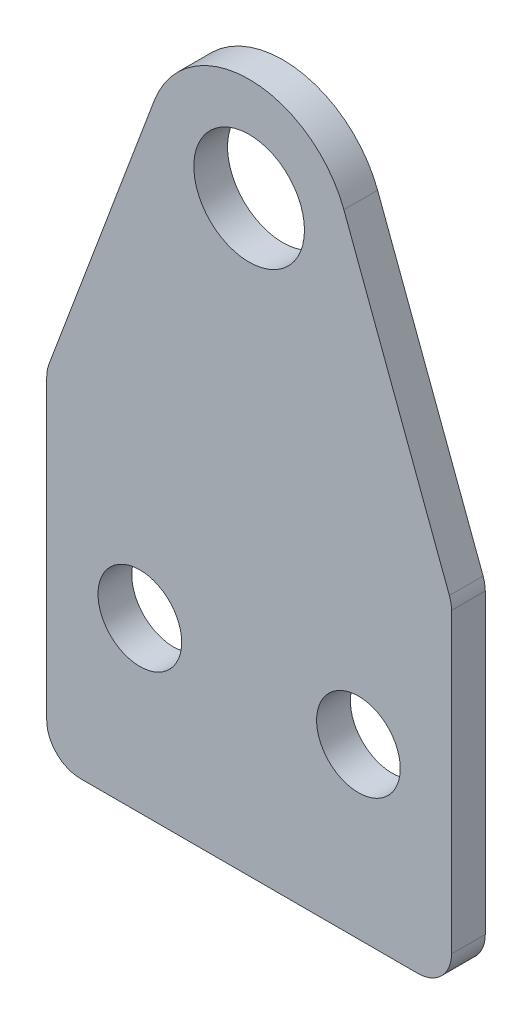
ISO-10303-21;
HEADER;
FILE_DESCRIPTION(('STEP AP214'),'2;1');
FILE_NAME('part.step','',(''),(''),'','','');
FILE_SCHEMA(('AUTOMOTIVE_DESIGN { 1 0 10303 214 1 1 1 1 }'));
ENDSEC;
DATA;
#1=APPLICATION_CONTEXT('core data for automotive mechanical design processes');
#2=APPLICATION_PROTOCOL_DEFINITION('international standard','automotive_design',2000,#1);
#3=PRODUCT_CONTEXT('',#1,'mechanical');
#4=PRODUCT('Part','Part','',(#3));
#5=PRODUCT_RELATED_PRODUCT_CATEGORY('part','',(#4));
#6=PRODUCT_DEFINITION_FORMATION('','',#4);
#7=PRODUCT_DEFINITION_CONTEXT('part definition',#1,'design');
#8=PRODUCT_DEFINITION('design','',#6,#7);
#9=PRODUCT_DEFINITION_SHAPE('','',#8);
#10=(LENGTH_UNIT() NAMED_UNIT(*) SI_UNIT(.MILLI.,.METRE.));
#11=(NAMED_UNIT(*) PLANE_ANGLE_UNIT() SI_UNIT($,.RADIAN.));
#12=(NAMED_UNIT(*) SI_UNIT($,.STERADIAN.) SOLID_ANGLE_UNIT());
#13=UNCERTAINTY_MEASURE_WITH_UNIT(LENGTH_MEASURE(1.E-05),#10,'distance_accuracy_value','');
#14=(GEOMETRIC_REPRESENTATION_CONTEXT(3) GLOBAL_UNCERTAINTY_ASSIGNED_CONTEXT((#13)) GLOBAL_UNIT_ASSIGNED_CONTEXT((#10,
#11,#12)) REPRESENTATION_CONTEXT('',''));
#15=CARTESIAN_POINT('',(0.,0.,0.));
#16=DIRECTION('',(0.,0.,1.));
#17=DIRECTION('',(1.,0.,0.));
#18=AXIS2_PLACEMENT_3D('',#15,#16,#17);
#19=CARTESIAN_POINT('',(0.,0.,2.5));
#20=DIRECTION('',(0.,0.,1.));
#21=DIRECTION('',(1.,0.,0.));
#22=AXIS2_PLACEMENT_3D('',#19,#20,#21);
#23=PLANE('',#22);
#24=CARTESIAN_POINT('',(8.1,0.,2.5));
#25=DIRECTION('',(0.,0.,1.));
#26=DIRECTION('',(1.,0.,0.));
#27=AXIS2_PLACEMENT_3D('',#24,#25,#26);
#28=CIRCLE('',#27,3.1);
#29=CARTESIAN_POINT('',(11.2,0.,2.5));
#30=VERTEX_POINT('',#29);
#31=EDGE_CURVE('E188',#30,#30,#28,.T.);
#32=ORIENTED_EDGE('',*,*,#31,.F.);
#33=EDGE_LOOP('',(#32));
#34=FACE_BOUND('',#33,.T.);
#35=DIRECTION('',(-0.351123441588392,0.936329177569044,0.));
#36=VECTOR('',#35,1.);
#37=CARTESIAN_POINT('',(0.,52.5,2.5));
#38=LINE('',#37,#36);
#39=CARTESIAN_POINT('',(14.8408229439226,12.9244721495397,2.5));
#40=VERTEX_POINT('',#39);
#41=CARTESIAN_POINT('',(7.02246883176783,33.7734164486191,2.5));
#42=VERTEX_POINT('',#41);
#43=EDGE_CURVE('E129',#40,#42,#38,.T.);
#44=ORIENTED_EDGE('',*,*,#43,.T.);
#45=CARTESIAN_POINT('',(0.,31.1399906367062,2.5));
#46=DIRECTION('',(0.,0.,1.));
#47=DIRECTION('',(1.,0.,0.));
#48=AXIS2_PLACEMENT_3D('',#45,#46,#47);
#49=CIRCLE('',#48,7.5);
#50=CARTESIAN_POINT('',(-7.02246883176784,33.7734164486191,2.5));
#51=VERTEX_POINT('',#50);
#52=EDGE_CURVE('E9',#42,#51,#49,.T.);
#53=ORIENTED_EDGE('',*,*,#52,.T.);
#54=DIRECTION('',(-0.351123441588392,-0.936329177569044,0.));
#55=VECTOR('',#54,1.);
#56=CARTESIAN_POINT('',(-15.,12.5,2.5));
#57=LINE('',#56,#55);
#58=CARTESIAN_POINT('',(-14.8408229439226,12.9244721495397,2.5));
#59=VERTEX_POINT('',#58);
#60=EDGE_CURVE('E165',#51,#59,#57,.T.);
#61=ORIENTED_EDGE('',*,*,#60,.T.);
#62=CARTESIAN_POINT('',(-12.5,12.0466635455687,2.5));
#63=DIRECTION('',(0.,0.,1.));
#64=DIRECTION('',(1.,0.,0.));
#65=AXIS2_PLACEMENT_3D('',#62,#63,#64);
#66=CIRCLE('',#65,2.5);
#67=CARTESIAN_POINT('',(-15.,12.0466635455687,2.5));
#68=VERTEX_POINT('',#67);
#69=EDGE_CURVE('E143',#59,#68,#66,.T.);
#70=ORIENTED_EDGE('',*,*,#69,.T.);
#71=DIRECTION('',(0.,-1.,0.));
#72=VECTOR('',#71,1.);
#73=CARTESIAN_POINT('',(-15.,-12.5,2.5));
#74=LINE('',#73,#72);
#75=CARTESIAN_POINT('',(-15.,-10.,2.5));
#76=VERTEX_POINT('',#75);
#77=EDGE_CURVE('E110',#68,#76,#74,.T.);
#78=ORIENTED_EDGE('',*,*,#77,.T.);
#79=CARTESIAN_POINT('',(-12.5,-10.,2.5));
#80=DIRECTION('',(0.,0.,1.));
#81=DIRECTION('',(1.,0.,0.));
#82=AXIS2_PLACEMENT_3D('',#79,#80,#81);
#83=CIRCLE('',#82,2.5);
#84=CARTESIAN_POINT('',(-12.5,-12.5,2.5));
#85=VERTEX_POINT('',#84);
#86=EDGE_CURVE('E137',#76,#85,#83,.T.);
#87=ORIENTED_EDGE('',*,*,#86,.T.);
#88=DIRECTION('',(1.,0.,0.));
#89=VECTOR('',#88,1.);
#90=CARTESIAN_POINT('',(-15.,-12.5,2.5));
#91=LINE('',#90,#89);
#92=CARTESIAN_POINT('',(12.5,-12.5,2.5));
#93=VERTEX_POINT('',#92);
#94=EDGE_CURVE('E180',#85,#93,#91,.T.);
#95=ORIENTED_EDGE('',*,*,#94,.T.);
#96=CARTESIAN_POINT('',(12.5,-10.,2.5));
#97=DIRECTION('',(0.,0.,1.));
#98=DIRECTION('',(1.,0.,0.));
#99=AXIS2_PLACEMENT_3D('',#96,#97,#98);
#100=CIRCLE('',#99,2.5);
#101=CARTESIAN_POINT('',(15.,-10.,2.5));
#102=VERTEX_POINT('',#101);
#103=EDGE_CURVE('E139',#93,#102,#100,.T.);
#104=ORIENTED_EDGE('',*,*,#103,.T.);
#105=DIRECTION('',(0.,1.,0.));
#106=VECTOR('',#105,1.);
#107=CARTESIAN_POINT('',(15.,-12.5,2.5));
#108=LINE('',#107,#106);
#109=CARTESIAN_POINT('',(15.,12.0466635455687,2.5));
#110=VERTEX_POINT('',#109);
#111=EDGE_CURVE('E130',#102,#110,#108,.T.);
#112=ORIENTED_EDGE('',*,*,#111,.T.);
#113=CARTESIAN_POINT('',(12.5,12.0466635455687,2.5));
#114=DIRECTION('',(0.,0.,1.));
#115=DIRECTION('',(1.,0.,0.));
#116=AXIS2_PLACEMENT_3D('',#113,#114,#115);
#117=CIRCLE('',#116,2.5);
#118=EDGE_CURVE('E141',#110,#40,#117,.T.);
#119=ORIENTED_EDGE('',*,*,#118,.T.);
#120=EDGE_LOOP('',(#44,#53,#61,#70,#78,#87,#95,#104,#112,#119));
#121=FACE_BOUND('',#120,.T.);
#122=CARTESIAN_POINT('',(-8.1,0.,2.5));
#123=DIRECTION('',(0.,0.,1.));
#124=DIRECTION('',(1.,0.,0.));
#125=AXIS2_PLACEMENT_3D('',#122,#123,#124);
#126=CIRCLE('',#125,3.1);
#127=CARTESIAN_POINT('',(-5.,0.,2.5));
#128=VERTEX_POINT('',#127);
#129=EDGE_CURVE('E183',#128,#128,#126,.T.);
#130=ORIENTED_EDGE('',*,*,#129,.F.);
#131=EDGE_LOOP('',(#130));
#132=FACE_BOUND('',#131,.T.);
#133=CARTESIAN_POINT('',(0.,31.,2.5));
#134=DIRECTION('',(0.,0.,1.));
#135=DIRECTION('',(1.,0.,0.));
#136=AXIS2_PLACEMENT_3D('',#133,#134,#135);
#137=CIRCLE('',#136,4.1);
#138=CARTESIAN_POINT('',(4.1,31.,2.5));
#139=VERTEX_POINT('',#138);
#140=EDGE_CURVE('E193',#139,#139,#137,.T.);
#141=ORIENTED_EDGE('',*,*,#140,.F.);
#142=EDGE_LOOP('',(#141));
#143=FACE_BOUND('',#142,.T.);
#144=ADVANCED_FACE('F15',(#34,#121,#132,#143),#23,.T.);
#145=CARTESIAN_POINT('',(0.,0.,0.));
#146=DIRECTION('',(0.,0.,1.));
#147=DIRECTION('',(1.,0.,0.));
#148=AXIS2_PLACEMENT_3D('',#145,#146,#147);
#149=PLANE('',#148);
#150=DIRECTION('',(-0.351123441588392,-0.936329177569044,0.));
#151=VECTOR('',#150,1.);
#152=CARTESIAN_POINT('',(-15.,12.5,0.));
#153=LINE('',#152,#151);
#154=CARTESIAN_POINT('',(-7.02246883176784,33.7734164486191,0.));
#155=VERTEX_POINT('',#154);
#156=CARTESIAN_POINT('',(-14.8408229439226,12.9244721495397,0.));
#157=VERTEX_POINT('',#156);
#158=EDGE_CURVE('E118',#155,#157,#153,.T.);
#159=ORIENTED_EDGE('',*,*,#158,.F.);
#160=CARTESIAN_POINT('',(0.,31.1399906367062,0.));
#161=DIRECTION('',(0.,0.,1.));
#162=DIRECTION('',(1.,0.,0.));
#163=AXIS2_PLACEMENT_3D('',#160,#161,#162);
#164=CIRCLE('',#163,7.5);
#165=CARTESIAN_POINT('',(7.02246883176783,33.7734164486191,0.));
#166=VERTEX_POINT('',#165);
#167=EDGE_CURVE('E37',#155,#166,#164,.F.);
#168=ORIENTED_EDGE('',*,*,#167,.T.);
#169=DIRECTION('',(-0.351123441588392,0.936329177569044,0.));
#170=VECTOR('',#169,1.);
#171=CARTESIAN_POINT('',(0.,52.5,0.));
#172=LINE('',#171,#170);
#173=CARTESIAN_POINT('',(14.8408229439226,12.9244721495397,0.));
#174=VERTEX_POINT('',#173);
#175=EDGE_CURVE('E123',#174,#166,#172,.T.);
#176=ORIENTED_EDGE('',*,*,#175,.F.);
#177=CARTESIAN_POINT('',(12.5,12.0466635455687,0.));
#178=DIRECTION('',(0.,0.,1.));
#179=DIRECTION('',(1.,0.,0.));
#180=AXIS2_PLACEMENT_3D('',#177,#178,#179);
#181=CIRCLE('',#180,2.5);
#182=CARTESIAN_POINT('',(15.,12.0466635455687,0.));
#183=VERTEX_POINT('',#182);
#184=EDGE_CURVE('E101',#174,#183,#181,.F.);
#185=ORIENTED_EDGE('',*,*,#184,.T.);
#186=DIRECTION('',(0.,1.,0.));
#187=VECTOR('',#186,1.);
#188=CARTESIAN_POINT('',(15.,-12.5,0.));
#189=LINE('',#188,#187);
#190=CARTESIAN_POINT('',(15.,-10.,0.));
#191=VERTEX_POINT('',#190);
#192=EDGE_CURVE('E121',#191,#183,#189,.T.);
#193=ORIENTED_EDGE('',*,*,#192,.F.);
#194=CARTESIAN_POINT('',(12.5,-10.,0.));
#195=DIRECTION('',(0.,0.,1.));
#196=DIRECTION('',(1.,0.,0.));
#197=AXIS2_PLACEMENT_3D('',#194,#195,#196);
#198=CIRCLE('',#197,2.5);
#199=CARTESIAN_POINT('',(12.5,-12.5,0.));
#200=VERTEX_POINT('',#199);
#201=EDGE_CURVE('E133',#191,#200,#198,.F.);
#202=ORIENTED_EDGE('',*,*,#201,.T.);
#203=DIRECTION('',(1.,0.,0.));
#204=VECTOR('',#203,1.);
#205=CARTESIAN_POINT('',(-15.,-12.5,0.));
#206=LINE('',#205,#204);
#207=CARTESIAN_POINT('',(-12.5,-12.5,0.));
#208=VERTEX_POINT('',#207);
#209=EDGE_CURVE('E117',#208,#200,#206,.T.);
#210=ORIENTED_EDGE('',*,*,#209,.F.);
#211=CARTESIAN_POINT('',(-12.5,-10.,0.));
#212=DIRECTION('',(0.,0.,1.));
#213=DIRECTION('',(1.,0.,0.));
#214=AXIS2_PLACEMENT_3D('',#211,#212,#213);
#215=CIRCLE('',#214,2.5);
#216=CARTESIAN_POINT('',(-15.,-10.,0.));
#217=VERTEX_POINT('',#216);
#218=EDGE_CURVE('E111',#208,#217,#215,.F.);
#219=ORIENTED_EDGE('',*,*,#218,.T.);
#220=DIRECTION('',(0.,-1.,0.));
#221=VECTOR('',#220,1.);
#222=CARTESIAN_POINT('',(-15.,-12.5,0.));
#223=LINE('',#222,#221);
#224=CARTESIAN_POINT('',(-15.,12.0466635455687,0.));
#225=VERTEX_POINT('',#224);
#226=EDGE_CURVE('E107',#225,#217,#223,.T.);
#227=ORIENTED_EDGE('',*,*,#226,.F.);
#228=CARTESIAN_POINT('',(-12.5,12.0466635455687,0.));
#229=DIRECTION('',(0.,0.,1.));
#230=DIRECTION('',(1.,0.,0.));
#231=AXIS2_PLACEMENT_3D('',#228,#229,#230);
#232=CIRCLE('',#231,2.5);
#233=EDGE_CURVE('E93',#225,#157,#232,.F.);
#234=ORIENTED_EDGE('',*,*,#233,.T.);
#235=EDGE_LOOP('',(#159,#168,#176,#185,#193,#202,#210,#219,#227,#234));
#236=FACE_BOUND('',#235,.T.);
#237=CARTESIAN_POINT('',(-8.1,0.,0.));
#238=DIRECTION('',(0.,0.,1.));
#239=DIRECTION('',(1.,0.,0.));
#240=AXIS2_PLACEMENT_3D('',#237,#238,#239);
#241=CIRCLE('',#240,3.1);
#242=CARTESIAN_POINT('',(-5.,0.,0.));
#243=VERTEX_POINT('',#242);
#244=EDGE_CURVE('E176',#243,#243,#241,.T.);
#245=ORIENTED_EDGE('',*,*,#244,.T.);
#246=EDGE_LOOP('',(#245));
#247=FACE_BOUND('',#246,.T.);
#248=CARTESIAN_POINT('',(8.1,0.,0.));
#249=DIRECTION('',(0.,0.,1.));
#250=DIRECTION('',(1.,0.,0.));
#251=AXIS2_PLACEMENT_3D('',#248,#249,#250);
#252=CIRCLE('',#251,3.1);
#253=CARTESIAN_POINT('',(11.2,0.,0.));
#254=VERTEX_POINT('',#253);
#255=EDGE_CURVE('E190',#254,#254,#252,.T.);
#256=ORIENTED_EDGE('',*,*,#255,.T.);
#257=EDGE_LOOP('',(#256));
#258=FACE_BOUND('',#257,.T.);
#259=CARTESIAN_POINT('',(0.,31.,0.));
#260=DIRECTION('',(0.,0.,1.));
#261=DIRECTION('',(1.,0.,0.));
#262=AXIS2_PLACEMENT_3D('',#259,#260,#261);
#263=CIRCLE('',#262,4.1);
#264=CARTESIAN_POINT('',(4.1,31.,0.));
#265=VERTEX_POINT('',#264);
#266=EDGE_CURVE('E196',#265,#265,#263,.T.);
#267=ORIENTED_EDGE('',*,*,#266,.T.);
#268=EDGE_LOOP('',(#267));
#269=FACE_BOUND('',#268,.T.);
#270=ADVANCED_FACE('F114',(#236,#247,#258,#269),#149,.F.);
#271=CARTESIAN_POINT('',(0.,52.5,2.5));
#272=DIRECTION('',(-0.936329177569045,-0.351123441588392,0.));
#273=DIRECTION('',(0.351123441588392,-0.936329177569045,0.));
#274=AXIS2_PLACEMENT_3D('',#271,#272,#273);
#275=PLANE('',#274);
#276=ORIENTED_EDGE('',*,*,#175,.T.);
#277=DIRECTION('',(0.,0.,-1.));
#278=VECTOR('',#277,1.);
#279=CARTESIAN_POINT('',(7.02246883176784,33.7734164486191,2.5));
#280=LINE('',#279,#278);
#281=EDGE_CURVE('E23',#166,#42,#280,.F.);
#282=ORIENTED_EDGE('',*,*,#281,.T.);
#283=ORIENTED_EDGE('',*,*,#43,.F.);
#284=DIRECTION('',(0.,0.,-1.));
#285=VECTOR('',#284,1.);
#286=CARTESIAN_POINT('',(14.8408229439226,12.9244721495397,2.5));
#287=LINE('',#286,#285);
#288=EDGE_CURVE('E145',#40,#174,#287,.T.);
#289=ORIENTED_EDGE('',*,*,#288,.T.);
#290=EDGE_LOOP('',(#276,#282,#283,#289));
#291=FACE_BOUND('',#290,.T.);
#292=ADVANCED_FACE('F212',(#291),#275,.F.);
#293=CARTESIAN_POINT('',(-15.,12.5,2.5));
#294=DIRECTION('',(0.936329177569045,-0.351123441588392,0.));
#295=DIRECTION('',(0.351123441588392,0.936329177569045,0.));
#296=AXIS2_PLACEMENT_3D('',#293,#294,#295);
#297=PLANE('',#296);
#298=ORIENTED_EDGE('',*,*,#60,.F.);
#299=DIRECTION('',(0.,0.,-1.));
#300=VECTOR('',#299,1.);
#301=CARTESIAN_POINT('',(-7.02246883176784,33.7734164486191,2.5));
#302=LINE('',#301,#300);
#303=EDGE_CURVE('E158',#51,#155,#302,.T.);
#304=ORIENTED_EDGE('',*,*,#303,.T.);
#305=ORIENTED_EDGE('',*,*,#158,.T.);
#306=DIRECTION('',(0.,0.,-1.));
#307=VECTOR('',#306,1.);
#308=CARTESIAN_POINT('',(-14.8408229439226,12.9244721495397,2.5));
#309=LINE('',#308,#307);
#310=EDGE_CURVE('E99',#157,#59,#309,.F.);
#311=ORIENTED_EDGE('',*,*,#310,.T.);
#312=EDGE_LOOP('',(#298,#304,#305,#311));
#313=FACE_BOUND('',#312,.T.);
#314=ADVANCED_FACE('F164',(#313),#297,.F.);
#315=CARTESIAN_POINT('',(-15.,-12.5,2.5));
#316=DIRECTION('',(1.,0.,0.));
#317=DIRECTION('',(0.,0.,-1.));
#318=AXIS2_PLACEMENT_3D('',#315,#316,#317);
#319=PLANE('',#318);
#320=ORIENTED_EDGE('',*,*,#77,.F.);
#321=DIRECTION('',(0.,0.,-1.));
#322=VECTOR('',#321,1.);
#323=CARTESIAN_POINT('',(-15.,12.0466635455687,2.5));
#324=LINE('',#323,#322);
#325=EDGE_CURVE('E97',#68,#225,#324,.T.);
#326=ORIENTED_EDGE('',*,*,#325,.T.);
#327=ORIENTED_EDGE('',*,*,#226,.T.);
#328=DIRECTION('',(0.,0.,-1.));
#329=VECTOR('',#328,1.);
#330=CARTESIAN_POINT('',(-15.,-10.,2.5));
#331=LINE('',#330,#329);
#332=EDGE_CURVE('E112',#217,#76,#331,.F.);
#333=ORIENTED_EDGE('',*,*,#332,.T.);
#334=EDGE_LOOP('',(#320,#326,#327,#333));
#335=FACE_BOUND('',#334,.T.);
#336=ADVANCED_FACE('F106',(#335),#319,.F.);
#337=CARTESIAN_POINT('',(-15.,-12.5,2.5));
#338=DIRECTION('',(0.,1.,0.));
#339=DIRECTION('',(0.,0.,1.));
#340=AXIS2_PLACEMENT_3D('',#337,#338,#339);
#341=PLANE('',#340);
#342=ORIENTED_EDGE('',*,*,#209,.T.);
#343=DIRECTION('',(0.,0.,-1.));
#344=VECTOR('',#343,1.);
#345=CARTESIAN_POINT('',(12.5,-12.5,2.5));
#346=LINE('',#345,#344);
#347=EDGE_CURVE('E156',#200,#93,#346,.F.);
#348=ORIENTED_EDGE('',*,*,#347,.T.);
#349=ORIENTED_EDGE('',*,*,#94,.F.);
#350=DIRECTION('',(0.,0.,-1.));
#351=VECTOR('',#350,1.);
#352=CARTESIAN_POINT('',(-12.5,-12.5,2.5));
#353=LINE('',#352,#351);
#354=EDGE_CURVE('E153',#85,#208,#353,.T.);
#355=ORIENTED_EDGE('',*,*,#354,.T.);
#356=EDGE_LOOP('',(#342,#348,#349,#355));
#357=FACE_BOUND('',#356,.T.);
#358=ADVANCED_FACE('F222',(#357),#341,.F.);
#359=CARTESIAN_POINT('',(15.,-12.5,2.5));
#360=DIRECTION('',(-1.,0.,0.));
#361=DIRECTION('',(0.,0.,1.));
#362=AXIS2_PLACEMENT_3D('',#359,#360,#361);
#363=PLANE('',#362);
#364=ORIENTED_EDGE('',*,*,#192,.T.);
#365=DIRECTION('',(0.,0.,-1.));
#366=VECTOR('',#365,1.);
#367=CARTESIAN_POINT('',(15.,12.0466635455687,2.5));
#368=LINE('',#367,#366);
#369=EDGE_CURVE('E151',#183,#110,#368,.F.);
#370=ORIENTED_EDGE('',*,*,#369,.T.);
#371=ORIENTED_EDGE('',*,*,#111,.F.);
#372=DIRECTION('',(0.,0.,-1.));
#373=VECTOR('',#372,1.);
#374=CARTESIAN_POINT('',(15.,-10.,2.5));
#375=LINE('',#374,#373);
#376=EDGE_CURVE('E148',#102,#191,#375,.T.);
#377=ORIENTED_EDGE('',*,*,#376,.T.);
#378=EDGE_LOOP('',(#364,#370,#371,#377));
#379=FACE_BOUND('',#378,.T.);
#380=ADVANCED_FACE('F219',(#379),#363,.F.);
#381=CARTESIAN_POINT('',(-8.1,0.,2.5));
#382=DIRECTION('',(0.,0.,-1.));
#383=DIRECTION('',(-1.,0.,0.));
#384=AXIS2_PLACEMENT_3D('',#381,#382,#383);
#385=CYLINDRICAL_SURFACE('',#384,3.1);
#386=ORIENTED_EDGE('',*,*,#129,.T.);
#387=EDGE_LOOP('',(#386));
#388=FACE_BOUND('',#387,.T.);
#389=ORIENTED_EDGE('',*,*,#244,.F.);
#390=EDGE_LOOP('',(#389));
#391=FACE_BOUND('',#390,.T.);
#392=ADVANCED_FACE('F216',(#388,#391),#385,.F.);
#393=CARTESIAN_POINT('',(8.1,0.,2.5));
#394=DIRECTION('',(0.,0.,-1.));
#395=DIRECTION('',(-1.,0.,0.));
#396=AXIS2_PLACEMENT_3D('',#393,#394,#395);
#397=CYLINDRICAL_SURFACE('',#396,3.1);
#398=ORIENTED_EDGE('',*,*,#31,.T.);
#399=EDGE_LOOP('',(#398));
#400=FACE_BOUND('',#399,.T.);
#401=ORIENTED_EDGE('',*,*,#255,.F.);
#402=EDGE_LOOP('',(#401));
#403=FACE_BOUND('',#402,.T.);
#404=ADVANCED_FACE('F299',(#400,#403),#397,.F.);
#405=CARTESIAN_POINT('',(0.,31.,2.5));
#406=DIRECTION('',(0.,0.,-1.));
#407=DIRECTION('',(-1.,0.,0.));
#408=AXIS2_PLACEMENT_3D('',#405,#406,#407);
#409=CYLINDRICAL_SURFACE('',#408,4.1);
#410=ORIENTED_EDGE('',*,*,#140,.T.);
#411=EDGE_LOOP('',(#410));
#412=FACE_BOUND('',#411,.T.);
#413=ORIENTED_EDGE('',*,*,#266,.F.);
#414=EDGE_LOOP('',(#413));
#415=FACE_BOUND('',#414,.T.);
#416=ADVANCED_FACE('F202',(#412,#415),#409,.F.);
#417=CARTESIAN_POINT('',(-12.5,12.0466635455687,2.5));
#418=DIRECTION('',(0.,0.,-1.));
#419=DIRECTION('',(-1.,0.,0.));
#420=AXIS2_PLACEMENT_3D('',#417,#418,#419);
#421=CYLINDRICAL_SURFACE('',#420,2.5);
#422=ORIENTED_EDGE('',*,*,#69,.F.);
#423=ORIENTED_EDGE('',*,*,#310,.F.);
#424=ORIENTED_EDGE('',*,*,#233,.F.);
#425=ORIENTED_EDGE('',*,*,#325,.F.);
#426=EDGE_LOOP('',(#422,#423,#424,#425));
#427=FACE_BOUND('',#426,.T.);
#428=ADVANCED_FACE('F96',(#427),#421,.T.);
#429=CARTESIAN_POINT('',(12.5,12.0466635455687,2.5));
#430=DIRECTION('',(0.,0.,-1.));
#431=DIRECTION('',(-1.,0.,0.));
#432=AXIS2_PLACEMENT_3D('',#429,#430,#431);
#433=CYLINDRICAL_SURFACE('',#432,2.5);
#434=ORIENTED_EDGE('',*,*,#118,.F.);
#435=ORIENTED_EDGE('',*,*,#369,.F.);
#436=ORIENTED_EDGE('',*,*,#184,.F.);
#437=ORIENTED_EDGE('',*,*,#288,.F.);
#438=EDGE_LOOP('',(#434,#435,#436,#437));
#439=FACE_BOUND('',#438,.T.);
#440=ADVANCED_FACE('F235',(#439),#433,.T.);
#441=CARTESIAN_POINT('',(12.5,-10.,2.5));
#442=DIRECTION('',(0.,0.,-1.));
#443=DIRECTION('',(-1.,0.,0.));
#444=AXIS2_PLACEMENT_3D('',#441,#442,#443);
#445=CYLINDRICAL_SURFACE('',#444,2.5);
#446=ORIENTED_EDGE('',*,*,#103,.F.);
#447=ORIENTED_EDGE('',*,*,#347,.F.);
#448=ORIENTED_EDGE('',*,*,#201,.F.);
#449=ORIENTED_EDGE('',*,*,#376,.F.);
#450=EDGE_LOOP('',(#446,#447,#448,#449));
#451=FACE_BOUND('',#450,.T.);
#452=ADVANCED_FACE('F238',(#451),#445,.T.);
#453=CARTESIAN_POINT('',(-12.5,-10.,2.5));
#454=DIRECTION('',(0.,0.,-1.));
#455=DIRECTION('',(-1.,0.,0.));
#456=AXIS2_PLACEMENT_3D('',#453,#454,#455);
#457=CYLINDRICAL_SURFACE('',#456,2.5);
#458=ORIENTED_EDGE('',*,*,#86,.F.);
#459=ORIENTED_EDGE('',*,*,#332,.F.);
#460=ORIENTED_EDGE('',*,*,#218,.F.);
#461=ORIENTED_EDGE('',*,*,#354,.F.);
#462=EDGE_LOOP('',(#458,#459,#460,#461));
#463=FACE_BOUND('',#462,.T.);
#464=ADVANCED_FACE('F241',(#463),#457,.T.);
#465=CARTESIAN_POINT('',(0.,31.1399906367062,2.5));
#466=DIRECTION('',(0.,0.,-1.));
#467=DIRECTION('',(-1.,0.,0.));
#468=AXIS2_PLACEMENT_3D('',#465,#466,#467);
#469=CYLINDRICAL_SURFACE('',#468,7.5);
#470=ORIENTED_EDGE('',*,*,#52,.F.);
#471=ORIENTED_EDGE('',*,*,#281,.F.);
#472=ORIENTED_EDGE('',*,*,#167,.F.);
#473=ORIENTED_EDGE('',*,*,#303,.F.);
#474=EDGE_LOOP('',(#470,#471,#472,#473));
#475=FACE_BOUND('',#474,.T.);
#476=ADVANCED_FACE('F17',(#475),#469,.T.);
#477=CLOSED_SHELL('',(#144,#270,#292,#314,#336,#358,#380,#392,#404,#416,#428,#440,#452,#464,#476));
#478=MANIFOLD_SOLID_BREP('B1',#477);
#479=ADVANCED_BREP_SHAPE_REPRESENTATION('',(#18,#478),#14);
#480=SHAPE_DEFINITION_REPRESENTATION(#9,#479);
ENDSEC;
END-ISO-10303-21;
